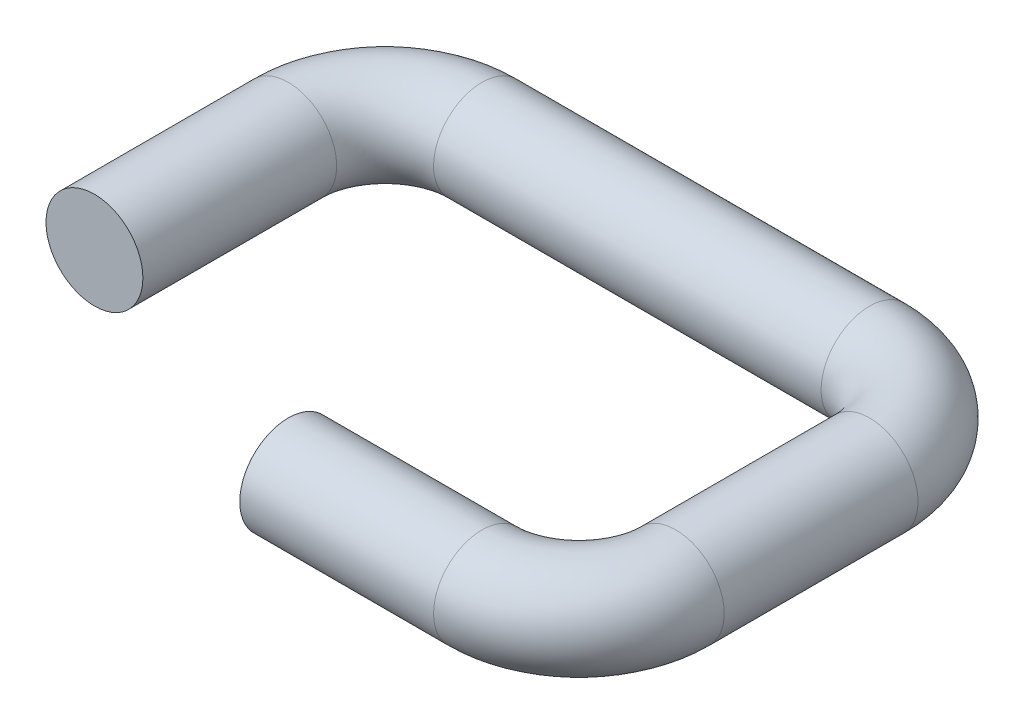
ISO-10303-21;
HEADER;
FILE_DESCRIPTION(('STEP AP214'),'2;1');
FILE_NAME('part.step','',(''),(''),'','','');
FILE_SCHEMA(('AUTOMOTIVE_DESIGN { 1 0 10303 214 1 1 1 1 }'));
ENDSEC;
DATA;
#1=APPLICATION_CONTEXT('core data for automotive mechanical design processes');
#2=APPLICATION_PROTOCOL_DEFINITION('international standard','automotive_design',2000,#1);
#3=PRODUCT_CONTEXT('',#1,'mechanical');
#4=PRODUCT('Part','Part','',(#3));
#5=PRODUCT_RELATED_PRODUCT_CATEGORY('part','',(#4));
#6=PRODUCT_DEFINITION_FORMATION('','',#4);
#7=PRODUCT_DEFINITION_CONTEXT('part definition',#1,'design');
#8=PRODUCT_DEFINITION('design','',#6,#7);
#9=PRODUCT_DEFINITION_SHAPE('','',#8);
#10=(LENGTH_UNIT() NAMED_UNIT(*) SI_UNIT(.MILLI.,.METRE.));
#11=(NAMED_UNIT(*) PLANE_ANGLE_UNIT() SI_UNIT($,.RADIAN.));
#12=(NAMED_UNIT(*) SI_UNIT($,.STERADIAN.) SOLID_ANGLE_UNIT());
#13=UNCERTAINTY_MEASURE_WITH_UNIT(LENGTH_MEASURE(1.E-05),#10,'distance_accuracy_value','');
#14=(GEOMETRIC_REPRESENTATION_CONTEXT(3) GLOBAL_UNCERTAINTY_ASSIGNED_CONTEXT((#13)) GLOBAL_UNIT_ASSIGNED_CONTEXT((#10,
#11,#12)) REPRESENTATION_CONTEXT('',''));
#15=CARTESIAN_POINT('',(0.,0.,0.));
#16=DIRECTION('',(0.,0.,1.));
#17=DIRECTION('',(1.,0.,0.));
#18=AXIS2_PLACEMENT_3D('',#15,#16,#17);
#19=CARTESIAN_POINT('',(0.,0.,0.));
#20=DIRECTION('',(0.,0.,1.));
#21=DIRECTION('',(1.,0.,0.));
#22=AXIS2_PLACEMENT_3D('',#19,#20,#21);
#23=PLANE('',#22);
#24=CARTESIAN_POINT('',(0.,0.,0.));
#25=DIRECTION('',(0.,0.,1.));
#26=DIRECTION('',(1.,0.,0.));
#27=AXIS2_PLACEMENT_3D('',#24,#25,#26);
#28=CIRCLE('',#27,2.5);
#29=CARTESIAN_POINT('',(2.5,0.,0.));
#30=VERTEX_POINT('',#29);
#31=EDGE_CURVE('E74',#30,#30,#28,.T.);
#32=ORIENTED_EDGE('',*,*,#31,.T.);
#33=EDGE_LOOP('',(#32));
#34=FACE_BOUND('',#33,.T.);
#35=ADVANCED_FACE('F46',(#34),#23,.T.);
#36=CARTESIAN_POINT('',(15.,0.,5.));
#37=DIRECTION('',(1.,0.,0.));
#38=DIRECTION('',(0.,0.,-1.));
#39=AXIS2_PLACEMENT_3D('',#36,#37,#38);
#40=PLANE('',#39);
#41=CARTESIAN_POINT('',(15.,0.,5.));
#42=DIRECTION('',(1.,0.,0.));
#43=DIRECTION('',(0.,0.,-1.));
#44=AXIS2_PLACEMENT_3D('',#41,#42,#43);
#45=CIRCLE('',#44,2.5);
#46=CARTESIAN_POINT('',(15.,0.,2.5));
#47=VERTEX_POINT('',#46);
#48=EDGE_CURVE('E11',#47,#47,#45,.T.);
#49=ORIENTED_EDGE('',*,*,#48,.F.);
#50=EDGE_LOOP('',(#49));
#51=FACE_BOUND('',#50,.T.);
#52=ADVANCED_FACE('F82',(#51),#40,.F.);
#53=CARTESIAN_POINT('',(0.,0.,0.));
#54=DIRECTION('',(0.,0.,-1.));
#55=DIRECTION('',(-1.,0.,0.));
#56=AXIS2_PLACEMENT_3D('',#53,#54,#55);
#57=CYLINDRICAL_SURFACE('',#56,2.5);
#58=CARTESIAN_POINT('',(0.,0.,-10.));
#59=DIRECTION('',(0.,0.,1.));
#60=DIRECTION('',(1.,0.,0.));
#61=AXIS2_PLACEMENT_3D('',#58,#59,#60);
#62=CIRCLE('',#61,2.5);
#63=CARTESIAN_POINT('',(-2.5,0.,-10.));
#64=VERTEX_POINT('',#63);
#65=EDGE_CURVE('E71',#64,#64,#62,.T.);
#66=ORIENTED_EDGE('',*,*,#65,.T.);
#67=EDGE_LOOP('',(#66));
#68=FACE_BOUND('',#67,.T.);
#69=ORIENTED_EDGE('',*,*,#31,.F.);
#70=EDGE_LOOP('',(#69));
#71=FACE_BOUND('',#70,.T.);
#72=ADVANCED_FACE('F79',(#68,#71),#57,.T.);
#73=CARTESIAN_POINT('',(5.,0.,-10.));
#74=DIRECTION('',(0.,-1.,0.));
#75=DIRECTION('',(0.,0.,-1.));
#76=AXIS2_PLACEMENT_3D('',#73,#74,#75);
#77=TOROIDAL_SURFACE('',#76,5.,2.5);
#78=CARTESIAN_POINT('',(5.,0.,-15.));
#79=DIRECTION('',(-1.,0.,0.));
#80=DIRECTION('',(0.,0.,1.));
#81=AXIS2_PLACEMENT_3D('',#78,#79,#80);
#82=CIRCLE('',#81,2.5);
#83=CARTESIAN_POINT('',(5.,0.,-17.5));
#84=VERTEX_POINT('',#83);
#85=EDGE_CURVE('E68',#84,#84,#82,.T.);
#86=CARTESIAN_POINT('',(5.,0.,-10.));
#87=DIRECTION('',(0.,-1.,0.));
#88=DIRECTION('',(0.,0.,-1.));
#89=AXIS2_PLACEMENT_3D('',#86,#87,#88);
#90=CIRCLE('',#89,7.5);
#91=EDGE_CURVE('',#64,#84,#90,.T.);
#92=ORIENTED_EDGE('',*,*,#65,.F.);
#93=ORIENTED_EDGE('',*,*,#85,.T.);
#94=ORIENTED_EDGE('',*,*,#91,.T.);
#95=ORIENTED_EDGE('',*,*,#91,.F.);
#96=EDGE_LOOP('',(#92,#94,#93,#95));
#97=FACE_BOUND('',#96,.T.);
#98=ADVANCED_FACE('F81',(#97),#77,.T.);
#99=CARTESIAN_POINT('',(5.,0.,-15.));
#100=DIRECTION('',(1.,0.,0.));
#101=DIRECTION('',(0.,0.,-1.));
#102=AXIS2_PLACEMENT_3D('',#99,#100,#101);
#103=CYLINDRICAL_SURFACE('',#102,2.5);
#104=CARTESIAN_POINT('',(25.,0.,-15.));
#105=DIRECTION('',(-1.,0.,0.));
#106=DIRECTION('',(0.,0.,1.));
#107=AXIS2_PLACEMENT_3D('',#104,#105,#106);
#108=CIRCLE('',#107,2.5);
#109=CARTESIAN_POINT('',(25.,0.,-17.5));
#110=VERTEX_POINT('',#109);
#111=EDGE_CURVE('E65',#110,#110,#108,.T.);
#112=ORIENTED_EDGE('',*,*,#111,.T.);
#113=EDGE_LOOP('',(#112));
#114=FACE_BOUND('',#113,.T.);
#115=ORIENTED_EDGE('',*,*,#85,.F.);
#116=EDGE_LOOP('',(#115));
#117=FACE_BOUND('',#116,.T.);
#118=ADVANCED_FACE('F89',(#114,#117),#103,.T.);
#119=CARTESIAN_POINT('',(25.,0.,-10.));
#120=DIRECTION('',(0.,-1.,0.));
#121=DIRECTION('',(0.,0.,-1.));
#122=AXIS2_PLACEMENT_3D('',#119,#120,#121);
#123=TOROIDAL_SURFACE('',#122,5.,2.5);
#124=CARTESIAN_POINT('',(30.,0.,-10.));
#125=DIRECTION('',(0.,0.,-1.));
#126=DIRECTION('',(-1.,0.,0.));
#127=AXIS2_PLACEMENT_3D('',#124,#125,#126);
#128=CIRCLE('',#127,2.5);
#129=CARTESIAN_POINT('',(32.5,0.,-10.));
#130=VERTEX_POINT('',#129);
#131=EDGE_CURVE('E60',#130,#130,#128,.T.);
#132=CARTESIAN_POINT('',(25.,0.,-10.));
#133=DIRECTION('',(0.,-1.,0.));
#134=DIRECTION('',(0.,0.,-1.));
#135=AXIS2_PLACEMENT_3D('',#132,#133,#134);
#136=CIRCLE('',#135,7.5);
#137=EDGE_CURVE('',#110,#130,#136,.T.);
#138=ORIENTED_EDGE('',*,*,#111,.F.);
#139=ORIENTED_EDGE('',*,*,#131,.T.);
#140=ORIENTED_EDGE('',*,*,#137,.T.);
#141=ORIENTED_EDGE('',*,*,#137,.F.);
#142=EDGE_LOOP('',(#138,#140,#139,#141));
#143=FACE_BOUND('',#142,.T.);
#144=ADVANCED_FACE('F106',(#143),#123,.T.);
#145=CARTESIAN_POINT('',(30.,0.,-10.));
#146=DIRECTION('',(0.,0.,1.));
#147=DIRECTION('',(1.,0.,0.));
#148=AXIS2_PLACEMENT_3D('',#145,#146,#147);
#149=CYLINDRICAL_SURFACE('',#148,2.5);
#150=CARTESIAN_POINT('',(30.,0.,0.));
#151=DIRECTION('',(0.,0.,-1.));
#152=DIRECTION('',(-1.,0.,0.));
#153=AXIS2_PLACEMENT_3D('',#150,#151,#152);
#154=CIRCLE('',#153,2.5);
#155=CARTESIAN_POINT('',(32.5,0.,0.));
#156=VERTEX_POINT('',#155);
#157=EDGE_CURVE('E56',#156,#156,#154,.T.);
#158=ORIENTED_EDGE('',*,*,#157,.T.);
#159=EDGE_LOOP('',(#158));
#160=FACE_BOUND('',#159,.T.);
#161=ORIENTED_EDGE('',*,*,#131,.F.);
#162=EDGE_LOOP('',(#161));
#163=FACE_BOUND('',#162,.T.);
#164=ADVANCED_FACE('F100',(#160,#163),#149,.T.);
#165=CARTESIAN_POINT('',(25.,0.,0.));
#166=DIRECTION('',(0.,-1.,0.));
#167=DIRECTION('',(0.,0.,-1.));
#168=AXIS2_PLACEMENT_3D('',#165,#166,#167);
#169=TOROIDAL_SURFACE('',#168,5.,2.5);
#170=CARTESIAN_POINT('',(25.,0.,5.));
#171=DIRECTION('',(1.,0.,0.));
#172=DIRECTION('',(0.,0.,-1.));
#173=AXIS2_PLACEMENT_3D('',#170,#171,#172);
#174=CIRCLE('',#173,2.5);
#175=CARTESIAN_POINT('',(25.,0.,7.5));
#176=VERTEX_POINT('',#175);
#177=EDGE_CURVE('E52',#176,#176,#174,.T.);
#178=CARTESIAN_POINT('',(25.,0.,0.));
#179=DIRECTION('',(0.,-1.,0.));
#180=DIRECTION('',(0.,0.,-1.));
#181=AXIS2_PLACEMENT_3D('',#178,#179,#180);
#182=CIRCLE('',#181,7.5);
#183=EDGE_CURVE('',#156,#176,#182,.T.);
#184=ORIENTED_EDGE('',*,*,#157,.F.);
#185=ORIENTED_EDGE('',*,*,#177,.T.);
#186=ORIENTED_EDGE('',*,*,#183,.T.);
#187=ORIENTED_EDGE('',*,*,#183,.F.);
#188=EDGE_LOOP('',(#184,#186,#185,#187));
#189=FACE_BOUND('',#188,.T.);
#190=ADVANCED_FACE('F95',(#189),#169,.T.);
#191=CARTESIAN_POINT('',(25.,0.,5.));
#192=DIRECTION('',(-1.,0.,0.));
#193=DIRECTION('',(0.,0.,1.));
#194=AXIS2_PLACEMENT_3D('',#191,#192,#193);
#195=CYLINDRICAL_SURFACE('',#194,2.5);
#196=ORIENTED_EDGE('',*,*,#48,.T.);
#197=EDGE_LOOP('',(#196));
#198=FACE_BOUND('',#197,.T.);
#199=ORIENTED_EDGE('',*,*,#177,.F.);
#200=EDGE_LOOP('',(#199));
#201=FACE_BOUND('',#200,.T.);
#202=ADVANCED_FACE('F93',(#198,#201),#195,.T.);
#203=CLOSED_SHELL('',(#35,#52,#72,#98,#118,#144,#164,#190,#202));
#204=MANIFOLD_SOLID_BREP('B2',#203);
#205=ADVANCED_BREP_SHAPE_REPRESENTATION('',(#18,#204),#14);
#206=SHAPE_DEFINITION_REPRESENTATION(#9,#205);
ENDSEC;
END-ISO-10303-21;
